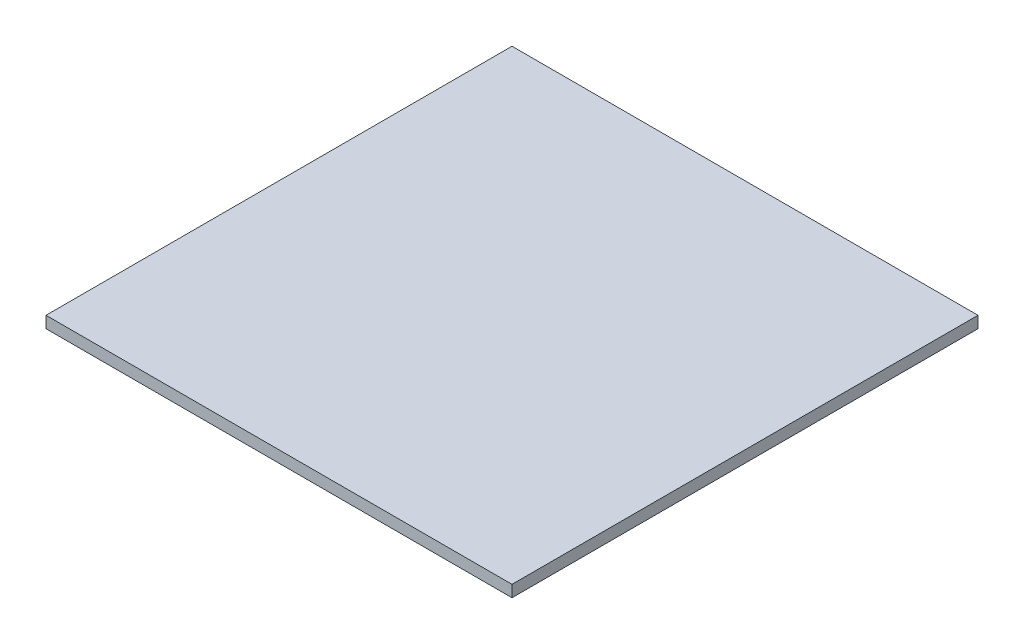
ISO-10303-21;
HEADER;
FILE_DESCRIPTION(('STEP AP214'),'2;1');
FILE_NAME('part.step','',(''),(''),'','','');
FILE_SCHEMA(('AUTOMOTIVE_DESIGN { 1 0 10303 214 1 1 1 1 }'));
ENDSEC;
DATA;
#1=APPLICATION_CONTEXT('core data for automotive mechanical design processes');
#2=APPLICATION_PROTOCOL_DEFINITION('international standard','automotive_design',2000,#1);
#3=PRODUCT_CONTEXT('',#1,'mechanical');
#4=PRODUCT('Part','Part','',(#3));
#5=PRODUCT_RELATED_PRODUCT_CATEGORY('part','',(#4));
#6=PRODUCT_DEFINITION_FORMATION('','',#4);
#7=PRODUCT_DEFINITION_CONTEXT('part definition',#1,'design');
#8=PRODUCT_DEFINITION('design','',#6,#7);
#9=PRODUCT_DEFINITION_SHAPE('','',#8);
#10=(LENGTH_UNIT() NAMED_UNIT(*) SI_UNIT(.MILLI.,.METRE.));
#11=(NAMED_UNIT(*) PLANE_ANGLE_UNIT() SI_UNIT($,.RADIAN.));
#12=(NAMED_UNIT(*) SI_UNIT($,.STERADIAN.) SOLID_ANGLE_UNIT());
#13=UNCERTAINTY_MEASURE_WITH_UNIT(LENGTH_MEASURE(1.E-05),#10,'distance_accuracy_value','');
#14=(GEOMETRIC_REPRESENTATION_CONTEXT(3) GLOBAL_UNCERTAINTY_ASSIGNED_CONTEXT((#13)) GLOBAL_UNIT_ASSIGNED_CONTEXT((#10,
#11,#12)) REPRESENTATION_CONTEXT('',''));
#15=CARTESIAN_POINT('',(0.,0.,0.));
#16=DIRECTION('',(0.,0.,1.));
#17=DIRECTION('',(1.,0.,0.));
#18=AXIS2_PLACEMENT_3D('',#15,#16,#17);
#19=CARTESIAN_POINT('',(200.,10.,200.));
#20=DIRECTION('',(-1.,0.,0.));
#21=DIRECTION('',(0.,0.,1.));
#22=AXIS2_PLACEMENT_3D('',#19,#20,#21);
#23=PLANE('',#22);
#24=DIRECTION('',(0.,0.,-1.));
#25=VECTOR('',#24,1.);
#26=CARTESIAN_POINT('',(200.,0.,200.));
#27=LINE('',#26,#25);
#28=CARTESIAN_POINT('',(200.,0.,200.));
#29=VERTEX_POINT('',#28);
#30=CARTESIAN_POINT('',(200.,0.,-200.));
#31=VERTEX_POINT('',#30);
#32=EDGE_CURVE('E107',#29,#31,#27,.T.);
#33=ORIENTED_EDGE('',*,*,#32,.T.);
#34=DIRECTION('',(0.,-1.,0.));
#35=VECTOR('',#34,1.);
#36=CARTESIAN_POINT('',(200.,10.,-200.));
#37=LINE('',#36,#35);
#38=CARTESIAN_POINT('',(200.,10.,-200.));
#39=VERTEX_POINT('',#38);
#40=EDGE_CURVE('E11',#39,#31,#37,.T.);
#41=ORIENTED_EDGE('',*,*,#40,.F.);
#42=DIRECTION('',(0.,0.,-1.));
#43=VECTOR('',#42,1.);
#44=CARTESIAN_POINT('',(200.,10.,200.));
#45=LINE('',#44,#43);
#46=CARTESIAN_POINT('',(200.,10.,200.));
#47=VERTEX_POINT('',#46);
#48=EDGE_CURVE('E91',#47,#39,#45,.T.);
#49=ORIENTED_EDGE('',*,*,#48,.F.);
#50=DIRECTION('',(0.,-1.,0.));
#51=VECTOR('',#50,1.);
#52=CARTESIAN_POINT('',(200.,10.,200.));
#53=LINE('',#52,#51);
#54=EDGE_CURVE('E103',#47,#29,#53,.T.);
#55=ORIENTED_EDGE('',*,*,#54,.T.);
#56=EDGE_LOOP('',(#33,#41,#49,#55));
#57=FACE_BOUND('',#56,.T.);
#58=ADVANCED_FACE('F39',(#57),#23,.F.);
#59=CARTESIAN_POINT('',(-200.,10.,-200.));
#60=DIRECTION('',(0.,0.,1.));
#61=DIRECTION('',(1.,0.,0.));
#62=AXIS2_PLACEMENT_3D('',#59,#60,#61);
#63=PLANE('',#62);
#64=DIRECTION('',(-1.,0.,0.));
#65=VECTOR('',#64,1.);
#66=CARTESIAN_POINT('',(-200.,0.,-200.));
#67=LINE('',#66,#65);
#68=CARTESIAN_POINT('',(-200.,0.,-200.));
#69=VERTEX_POINT('',#68);
#70=EDGE_CURVE('E96',#31,#69,#67,.T.);
#71=ORIENTED_EDGE('',*,*,#70,.T.);
#72=DIRECTION('',(0.,-1.,0.));
#73=VECTOR('',#72,1.);
#74=CARTESIAN_POINT('',(-200.,10.,-200.));
#75=LINE('',#74,#73);
#76=CARTESIAN_POINT('',(-200.,10.,-200.));
#77=VERTEX_POINT('',#76);
#78=EDGE_CURVE('E48',#77,#69,#75,.T.);
#79=ORIENTED_EDGE('',*,*,#78,.F.);
#80=DIRECTION('',(-1.,0.,0.));
#81=VECTOR('',#80,1.);
#82=CARTESIAN_POINT('',(-200.,10.,-200.));
#83=LINE('',#82,#81);
#84=EDGE_CURVE('E86',#39,#77,#83,.T.);
#85=ORIENTED_EDGE('',*,*,#84,.F.);
#86=ORIENTED_EDGE('',*,*,#40,.T.);
#87=EDGE_LOOP('',(#71,#79,#85,#86));
#88=FACE_BOUND('',#87,.T.);
#89=ADVANCED_FACE('F95',(#88),#63,.F.);
#90=CARTESIAN_POINT('',(-200.,10.,200.));
#91=DIRECTION('',(1.,0.,0.));
#92=DIRECTION('',(0.,0.,-1.));
#93=AXIS2_PLACEMENT_3D('',#90,#91,#92);
#94=PLANE('',#93);
#95=DIRECTION('',(0.,0.,1.));
#96=VECTOR('',#95,1.);
#97=CARTESIAN_POINT('',(-200.,0.,200.));
#98=LINE('',#97,#96);
#99=CARTESIAN_POINT('',(-200.,0.,200.));
#100=VERTEX_POINT('',#99);
#101=EDGE_CURVE('E73',#69,#100,#98,.T.);
#102=ORIENTED_EDGE('',*,*,#101,.T.);
#103=DIRECTION('',(0.,-1.,0.));
#104=VECTOR('',#103,1.);
#105=CARTESIAN_POINT('',(-200.,10.,200.));
#106=LINE('',#105,#104);
#107=CARTESIAN_POINT('',(-200.,10.,200.));
#108=VERTEX_POINT('',#107);
#109=EDGE_CURVE('E98',#108,#100,#106,.T.);
#110=ORIENTED_EDGE('',*,*,#109,.F.);
#111=DIRECTION('',(0.,0.,1.));
#112=VECTOR('',#111,1.);
#113=CARTESIAN_POINT('',(-200.,10.,200.));
#114=LINE('',#113,#112);
#115=EDGE_CURVE('E89',#77,#108,#114,.T.);
#116=ORIENTED_EDGE('',*,*,#115,.F.);
#117=ORIENTED_EDGE('',*,*,#78,.T.);
#118=EDGE_LOOP('',(#102,#110,#116,#117));
#119=FACE_BOUND('',#118,.T.);
#120=ADVANCED_FACE('F99',(#119),#94,.F.);
#121=CARTESIAN_POINT('',(-200.,10.,200.));
#122=DIRECTION('',(0.,0.,-1.));
#123=DIRECTION('',(-1.,0.,0.));
#124=AXIS2_PLACEMENT_3D('',#121,#122,#123);
#125=PLANE('',#124);
#126=DIRECTION('',(1.,0.,0.));
#127=VECTOR('',#126,1.);
#128=CARTESIAN_POINT('',(-200.,0.,200.));
#129=LINE('',#128,#127);
#130=EDGE_CURVE('E79',#100,#29,#129,.T.);
#131=ORIENTED_EDGE('',*,*,#130,.T.);
#132=ORIENTED_EDGE('',*,*,#54,.F.);
#133=DIRECTION('',(1.,0.,0.));
#134=VECTOR('',#133,1.);
#135=CARTESIAN_POINT('',(-200.,10.,200.));
#136=LINE('',#135,#134);
#137=EDGE_CURVE('E56',#108,#47,#136,.T.);
#138=ORIENTED_EDGE('',*,*,#137,.F.);
#139=ORIENTED_EDGE('',*,*,#109,.T.);
#140=EDGE_LOOP('',(#131,#132,#138,#139));
#141=FACE_BOUND('',#140,.T.);
#142=ADVANCED_FACE('F120',(#141),#125,.F.);
#143=CARTESIAN_POINT('',(0.,10.,0.));
#144=DIRECTION('',(0.,-1.,0.));
#145=DIRECTION('',(0.,0.,-1.));
#146=AXIS2_PLACEMENT_3D('',#143,#144,#145);
#147=PLANE('',#146);
#148=ORIENTED_EDGE('',*,*,#48,.T.);
#149=ORIENTED_EDGE('',*,*,#84,.T.);
#150=ORIENTED_EDGE('',*,*,#115,.T.);
#151=ORIENTED_EDGE('',*,*,#137,.T.);
#152=EDGE_LOOP('',(#148,#149,#150,#151));
#153=FACE_BOUND('',#152,.T.);
#154=ADVANCED_FACE('F87',(#153),#147,.F.);
#155=CARTESIAN_POINT('',(0.,0.,0.));
#156=DIRECTION('',(0.,-1.,0.));
#157=DIRECTION('',(0.,0.,-1.));
#158=AXIS2_PLACEMENT_3D('',#155,#156,#157);
#159=PLANE('',#158);
#160=ORIENTED_EDGE('',*,*,#32,.F.);
#161=ORIENTED_EDGE('',*,*,#130,.F.);
#162=ORIENTED_EDGE('',*,*,#101,.F.);
#163=ORIENTED_EDGE('',*,*,#70,.F.);
#164=EDGE_LOOP('',(#160,#161,#162,#163));
#165=FACE_BOUND('',#164,.T.);
#166=ADVANCED_FACE('F123',(#165),#159,.T.);
#167=CLOSED_SHELL('',(#58,#89,#120,#142,#154,#166));
#168=MANIFOLD_SOLID_BREP('B2',#167);
#169=ADVANCED_BREP_SHAPE_REPRESENTATION('',(#18,#168),#14);
#170=SHAPE_DEFINITION_REPRESENTATION(#9,#169);
ENDSEC;
END-ISO-10303-21;
